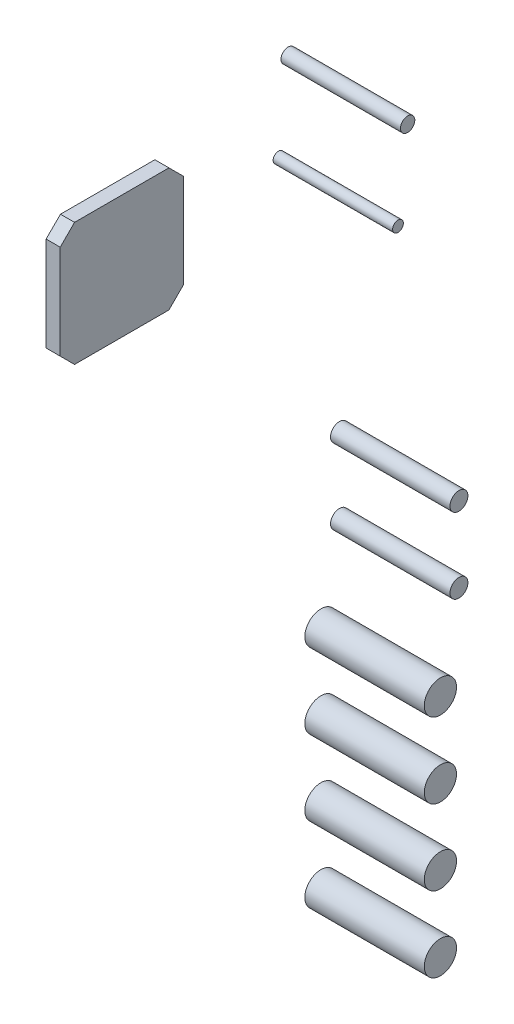
ISO-10303-21;
HEADER;
FILE_DESCRIPTION(('STEP AP214'),'2;1');
FILE_NAME('part.step','',(''),(''),'','','');
FILE_SCHEMA(('AUTOMOTIVE_DESIGN { 1 0 10303 214 1 1 1 1 }'));
ENDSEC;
DATA;
#1=APPLICATION_CONTEXT('core data for automotive mechanical design processes');
#2=APPLICATION_PROTOCOL_DEFINITION('international standard','automotive_design',2000,#1);
#3=PRODUCT_CONTEXT('',#1,'mechanical');
#4=PRODUCT('Part','Part','',(#3));
#5=PRODUCT_RELATED_PRODUCT_CATEGORY('part','',(#4));
#6=PRODUCT_DEFINITION_FORMATION('','',#4);
#7=PRODUCT_DEFINITION_CONTEXT('part definition',#1,'design');
#8=PRODUCT_DEFINITION('design','',#6,#7);
#9=PRODUCT_DEFINITION_SHAPE('','',#8);
#10=(LENGTH_UNIT() NAMED_UNIT(*) SI_UNIT(.MILLI.,.METRE.));
#11=(NAMED_UNIT(*) PLANE_ANGLE_UNIT() SI_UNIT($,.RADIAN.));
#12=(NAMED_UNIT(*) SI_UNIT($,.STERADIAN.) SOLID_ANGLE_UNIT());
#13=UNCERTAINTY_MEASURE_WITH_UNIT(LENGTH_MEASURE(1.E-05),#10,'distance_accuracy_value','');
#14=(GEOMETRIC_REPRESENTATION_CONTEXT(3) GLOBAL_UNCERTAINTY_ASSIGNED_CONTEXT((#13)) GLOBAL_UNIT_ASSIGNED_CONTEXT((#10,
#11,#12)) REPRESENTATION_CONTEXT('',''));
#15=CARTESIAN_POINT('',(0.,0.,0.));
#16=DIRECTION('',(0.,0.,1.));
#17=DIRECTION('',(1.,0.,0.));
#18=AXIS2_PLACEMENT_3D('',#15,#16,#17);
#19=CARTESIAN_POINT('',(11.8,412.5,114.));
#20=DIRECTION('',(0.,0.707106781186547,0.707106781186548));
#21=DIRECTION('',(0.,0.707106781186548,-0.707106781186547));
#22=AXIS2_PLACEMENT_3D('',#19,#20,#21);
#23=PLANE('',#22);
#24=DIRECTION('',(0.,0.707106781186548,-0.707106781186547));
#25=VECTOR('',#24,1.);
#26=CARTESIAN_POINT('',(0.,412.5,114.));
#27=LINE('',#26,#25);
#28=CARTESIAN_POINT('',(0.,412.5,114.));
#29=VERTEX_POINT('',#28);
#30=CARTESIAN_POINT('',(0.,424.5,102.));
#31=VERTEX_POINT('',#30);
#32=EDGE_CURVE('E122',#29,#31,#27,.T.);
#33=ORIENTED_EDGE('',*,*,#32,.T.);
#34=DIRECTION('',(-1.,0.,0.));
#35=VECTOR('',#34,1.);
#36=CARTESIAN_POINT('',(11.8,424.5,102.));
#37=LINE('',#36,#35);
#38=CARTESIAN_POINT('',(11.8,424.5,102.));
#39=VERTEX_POINT('',#38);
#40=EDGE_CURVE('E11',#39,#31,#37,.T.);
#41=ORIENTED_EDGE('',*,*,#40,.F.);
#42=DIRECTION('',(0.,0.707106781186548,-0.707106781186547));
#43=VECTOR('',#42,1.);
#44=CARTESIAN_POINT('',(11.8,412.5,114.));
#45=LINE('',#44,#43);
#46=CARTESIAN_POINT('',(11.8,412.5,114.));
#47=VERTEX_POINT('',#46);
#48=EDGE_CURVE('E116',#47,#39,#45,.T.);
#49=ORIENTED_EDGE('',*,*,#48,.F.);
#50=DIRECTION('',(-1.,0.,0.));
#51=VECTOR('',#50,1.);
#52=CARTESIAN_POINT('',(11.8,412.5,114.));
#53=LINE('',#52,#51);
#54=EDGE_CURVE('E112',#47,#29,#53,.T.);
#55=ORIENTED_EDGE('',*,*,#54,.T.);
#56=EDGE_LOOP('',(#33,#41,#49,#55));
#57=FACE_BOUND('',#56,.T.);
#58=ADVANCED_FACE('F17',(#57),#23,.F.);
#59=CARTESIAN_POINT('',(11.8,424.5,102.));
#60=DIRECTION('',(0.,0.,1.));
#61=DIRECTION('',(0.,1.,0.));
#62=AXIS2_PLACEMENT_3D('',#59,#60,#61);
#63=PLANE('',#62);
#64=DIRECTION('',(0.,1.,0.));
#65=VECTOR('',#64,1.);
#66=CARTESIAN_POINT('',(0.,424.5,102.));
#67=LINE('',#66,#65);
#68=CARTESIAN_POINT('',(0.,503.5,102.));
#69=VERTEX_POINT('',#68);
#70=EDGE_CURVE('E118',#31,#69,#67,.T.);
#71=ORIENTED_EDGE('',*,*,#70,.T.);
#72=DIRECTION('',(-1.,0.,0.));
#73=VECTOR('',#72,1.);
#74=CARTESIAN_POINT('',(11.8,503.5,102.));
#75=LINE('',#74,#73);
#76=CARTESIAN_POINT('',(11.8,503.5,102.));
#77=VERTEX_POINT('',#76);
#78=EDGE_CURVE('E27',#77,#69,#75,.T.);
#79=ORIENTED_EDGE('',*,*,#78,.F.);
#80=DIRECTION('',(0.,1.,0.));
#81=VECTOR('',#80,1.);
#82=CARTESIAN_POINT('',(11.8,424.5,102.));
#83=LINE('',#82,#81);
#84=EDGE_CURVE('E79',#39,#77,#83,.T.);
#85=ORIENTED_EDGE('',*,*,#84,.F.);
#86=ORIENTED_EDGE('',*,*,#40,.T.);
#87=EDGE_LOOP('',(#71,#79,#85,#86));
#88=FACE_BOUND('',#87,.T.);
#89=ADVANCED_FACE('F572',(#88),#63,.F.);
#90=CARTESIAN_POINT('',(11.8,515.5,114.));
#91=DIRECTION('',(0.,-0.707106781186548,0.707106781186547));
#92=DIRECTION('',(0.,0.707106781186547,0.707106781186548));
#93=AXIS2_PLACEMENT_3D('',#90,#91,#92);
#94=PLANE('',#93);
#95=DIRECTION('',(0.,0.707106781186547,0.707106781186548));
#96=VECTOR('',#95,1.);
#97=CARTESIAN_POINT('',(0.,515.5,114.));
#98=LINE('',#97,#96);
#99=CARTESIAN_POINT('',(0.,515.5,114.));
#100=VERTEX_POINT('',#99);
#101=EDGE_CURVE('E121',#69,#100,#98,.T.);
#102=ORIENTED_EDGE('',*,*,#101,.T.);
#103=DIRECTION('',(-1.,0.,0.));
#104=VECTOR('',#103,1.);
#105=CARTESIAN_POINT('',(11.8,515.5,114.));
#106=LINE('',#105,#104);
#107=CARTESIAN_POINT('',(11.8,515.5,114.));
#108=VERTEX_POINT('',#107);
#109=EDGE_CURVE('E147',#108,#100,#106,.T.);
#110=ORIENTED_EDGE('',*,*,#109,.F.);
#111=DIRECTION('',(0.,0.707106781186547,0.707106781186548));
#112=VECTOR('',#111,1.);
#113=CARTESIAN_POINT('',(11.8,515.5,114.));
#114=LINE('',#113,#112);
#115=EDGE_CURVE('E994',#77,#108,#114,.T.);
#116=ORIENTED_EDGE('',*,*,#115,.F.);
#117=ORIENTED_EDGE('',*,*,#78,.T.);
#118=EDGE_LOOP('',(#102,#110,#116,#117));
#119=FACE_BOUND('',#118,.T.);
#120=ADVANCED_FACE('F561',(#119),#94,.F.);
#121=CARTESIAN_POINT('',(11.8,515.5,114.));
#122=DIRECTION('',(0.,-1.,0.));
#123=DIRECTION('',(0.,0.,1.));
#124=AXIS2_PLACEMENT_3D('',#121,#122,#123);
#125=PLANE('',#124);
#126=DIRECTION('',(0.,0.,1.));
#127=VECTOR('',#126,1.);
#128=CARTESIAN_POINT('',(0.,515.5,114.));
#129=LINE('',#128,#127);
#130=CARTESIAN_POINT('',(0.,515.5,193.));
#131=VERTEX_POINT('',#130);
#132=EDGE_CURVE('E125',#100,#131,#129,.T.);
#133=ORIENTED_EDGE('',*,*,#132,.T.);
#134=DIRECTION('',(-1.,0.,0.));
#135=VECTOR('',#134,1.);
#136=CARTESIAN_POINT('',(11.8,515.5,193.));
#137=LINE('',#136,#135);
#138=CARTESIAN_POINT('',(11.8,515.5,193.));
#139=VERTEX_POINT('',#138);
#140=EDGE_CURVE('E144',#139,#131,#137,.T.);
#141=ORIENTED_EDGE('',*,*,#140,.F.);
#142=DIRECTION('',(0.,0.,1.));
#143=VECTOR('',#142,1.);
#144=CARTESIAN_POINT('',(11.8,515.5,114.));
#145=LINE('',#144,#143);
#146=EDGE_CURVE('E996',#108,#139,#145,.T.);
#147=ORIENTED_EDGE('',*,*,#146,.F.);
#148=ORIENTED_EDGE('',*,*,#109,.T.);
#149=EDGE_LOOP('',(#133,#141,#147,#148));
#150=FACE_BOUND('',#149,.T.);
#151=ADVANCED_FACE('F550',(#150),#125,.F.);
#152=CARTESIAN_POINT('',(11.8,503.5,205.));
#153=DIRECTION('',(0.,-0.707106781186548,-0.707106781186548));
#154=DIRECTION('',(0.,-0.707106781186548,0.707106781186548));
#155=AXIS2_PLACEMENT_3D('',#152,#153,#154);
#156=PLANE('',#155);
#157=DIRECTION('',(0.,-0.707106781186548,0.707106781186548));
#158=VECTOR('',#157,1.);
#159=CARTESIAN_POINT('',(0.,503.5,205.));
#160=LINE('',#159,#158);
#161=CARTESIAN_POINT('',(0.,503.5,205.));
#162=VERTEX_POINT('',#161);
#163=EDGE_CURVE('E128',#131,#162,#160,.T.);
#164=ORIENTED_EDGE('',*,*,#163,.T.);
#165=DIRECTION('',(-1.,0.,0.));
#166=VECTOR('',#165,1.);
#167=CARTESIAN_POINT('',(11.8,503.5,205.));
#168=LINE('',#167,#166);
#169=CARTESIAN_POINT('',(11.8,503.5,205.));
#170=VERTEX_POINT('',#169);
#171=EDGE_CURVE('E107',#170,#162,#168,.T.);
#172=ORIENTED_EDGE('',*,*,#171,.F.);
#173=DIRECTION('',(0.,-0.707106781186548,0.707106781186548));
#174=VECTOR('',#173,1.);
#175=CARTESIAN_POINT('',(11.8,503.5,205.));
#176=LINE('',#175,#174);
#177=EDGE_CURVE('E98',#139,#170,#176,.T.);
#178=ORIENTED_EDGE('',*,*,#177,.F.);
#179=ORIENTED_EDGE('',*,*,#140,.T.);
#180=EDGE_LOOP('',(#164,#172,#178,#179));
#181=FACE_BOUND('',#180,.T.);
#182=ADVANCED_FACE('F540',(#181),#156,.F.);
#183=CARTESIAN_POINT('',(11.8,503.5,205.));
#184=DIRECTION('',(0.,0.,-1.));
#185=DIRECTION('',(0.,-1.,0.));
#186=AXIS2_PLACEMENT_3D('',#183,#184,#185);
#187=PLANE('',#186);
#188=DIRECTION('',(0.,-1.,0.));
#189=VECTOR('',#188,1.);
#190=CARTESIAN_POINT('',(0.,503.5,205.));
#191=LINE('',#190,#189);
#192=CARTESIAN_POINT('',(0.,424.5,205.));
#193=VERTEX_POINT('',#192);
#194=EDGE_CURVE('E106',#162,#193,#191,.T.);
#195=ORIENTED_EDGE('',*,*,#194,.T.);
#196=DIRECTION('',(-1.,0.,0.));
#197=VECTOR('',#196,1.);
#198=CARTESIAN_POINT('',(11.8,424.5,205.));
#199=LINE('',#198,#197);
#200=CARTESIAN_POINT('',(11.8,424.5,205.));
#201=VERTEX_POINT('',#200);
#202=EDGE_CURVE('E103',#201,#193,#199,.T.);
#203=ORIENTED_EDGE('',*,*,#202,.F.);
#204=DIRECTION('',(0.,-1.,0.));
#205=VECTOR('',#204,1.);
#206=CARTESIAN_POINT('',(11.8,503.5,205.));
#207=LINE('',#206,#205);
#208=EDGE_CURVE('E92',#170,#201,#207,.T.);
#209=ORIENTED_EDGE('',*,*,#208,.F.);
#210=ORIENTED_EDGE('',*,*,#171,.T.);
#211=EDGE_LOOP('',(#195,#203,#209,#210));
#212=FACE_BOUND('',#211,.T.);
#213=ADVANCED_FACE('F104',(#212),#187,.F.);
#214=CARTESIAN_POINT('',(11.8,412.5,193.));
#215=DIRECTION('',(0.,0.707106781186548,-0.707106781186547));
#216=DIRECTION('',(0.,-0.707106781186547,-0.707106781186548));
#217=AXIS2_PLACEMENT_3D('',#214,#215,#216);
#218=PLANE('',#217);
#219=DIRECTION('',(0.,-0.707106781186547,-0.707106781186548));
#220=VECTOR('',#219,1.);
#221=CARTESIAN_POINT('',(0.,412.5,193.));
#222=LINE('',#221,#220);
#223=CARTESIAN_POINT('',(0.,412.5,193.));
#224=VERTEX_POINT('',#223);
#225=EDGE_CURVE('E65',#193,#224,#222,.T.);
#226=ORIENTED_EDGE('',*,*,#225,.T.);
#227=DIRECTION('',(-1.,0.,0.));
#228=VECTOR('',#227,1.);
#229=CARTESIAN_POINT('',(11.8,412.5,193.));
#230=LINE('',#229,#228);
#231=CARTESIAN_POINT('',(11.8,412.5,193.));
#232=VERTEX_POINT('',#231);
#233=EDGE_CURVE('E108',#232,#224,#230,.T.);
#234=ORIENTED_EDGE('',*,*,#233,.F.);
#235=DIRECTION('',(0.,-0.707106781186547,-0.707106781186548));
#236=VECTOR('',#235,1.);
#237=CARTESIAN_POINT('',(11.8,412.5,193.));
#238=LINE('',#237,#236);
#239=EDGE_CURVE('E96',#201,#232,#238,.T.);
#240=ORIENTED_EDGE('',*,*,#239,.F.);
#241=ORIENTED_EDGE('',*,*,#202,.T.);
#242=EDGE_LOOP('',(#226,#234,#240,#241));
#243=FACE_BOUND('',#242,.T.);
#244=ADVANCED_FACE('F110',(#243),#218,.F.);
#245=CARTESIAN_POINT('',(11.8,412.5,193.));
#246=DIRECTION('',(0.,1.,0.));
#247=DIRECTION('',(0.,0.,-1.));
#248=AXIS2_PLACEMENT_3D('',#245,#246,#247);
#249=PLANE('',#248);
#250=DIRECTION('',(0.,0.,-1.));
#251=VECTOR('',#250,1.);
#252=CARTESIAN_POINT('',(0.,412.5,193.));
#253=LINE('',#252,#251);
#254=EDGE_CURVE('E71',#224,#29,#253,.T.);
#255=ORIENTED_EDGE('',*,*,#254,.T.);
#256=ORIENTED_EDGE('',*,*,#54,.F.);
#257=DIRECTION('',(0.,0.,-1.));
#258=VECTOR('',#257,1.);
#259=CARTESIAN_POINT('',(11.8,412.5,193.));
#260=LINE('',#259,#258);
#261=EDGE_CURVE('E36',#232,#47,#260,.T.);
#262=ORIENTED_EDGE('',*,*,#261,.F.);
#263=ORIENTED_EDGE('',*,*,#233,.T.);
#264=EDGE_LOOP('',(#255,#256,#262,#263));
#265=FACE_BOUND('',#264,.T.);
#266=ADVANCED_FACE('F512',(#265),#249,.F.);
#267=CARTESIAN_POINT('',(11.8,464.,153.5));
#268=DIRECTION('',(1.,0.,0.));
#269=DIRECTION('',(0.,0.,-1.));
#270=AXIS2_PLACEMENT_3D('',#267,#268,#269);
#271=PLANE('',#270);
#272=ORIENTED_EDGE('',*,*,#48,.T.);
#273=ORIENTED_EDGE('',*,*,#84,.T.);
#274=ORIENTED_EDGE('',*,*,#115,.T.);
#275=ORIENTED_EDGE('',*,*,#146,.T.);
#276=ORIENTED_EDGE('',*,*,#177,.T.);
#277=ORIENTED_EDGE('',*,*,#208,.T.);
#278=ORIENTED_EDGE('',*,*,#239,.T.);
#279=ORIENTED_EDGE('',*,*,#261,.T.);
#280=EDGE_LOOP('',(#272,#273,#274,#275,#276,#277,#278,#279));
#281=FACE_BOUND('',#280,.T.);
#282=ADVANCED_FACE('F94',(#281),#271,.T.);
#283=CARTESIAN_POINT('',(0.,464.,153.5));
#284=DIRECTION('',(1.,0.,0.));
#285=DIRECTION('',(0.,0.,-1.));
#286=AXIS2_PLACEMENT_3D('',#283,#284,#285);
#287=PLANE('',#286);
#288=ORIENTED_EDGE('',*,*,#32,.F.);
#289=ORIENTED_EDGE('',*,*,#254,.F.);
#290=ORIENTED_EDGE('',*,*,#225,.F.);
#291=ORIENTED_EDGE('',*,*,#194,.F.);
#292=ORIENTED_EDGE('',*,*,#163,.F.);
#293=ORIENTED_EDGE('',*,*,#132,.F.);
#294=ORIENTED_EDGE('',*,*,#101,.F.);
#295=ORIENTED_EDGE('',*,*,#70,.F.);
#296=EDGE_LOOP('',(#288,#289,#290,#291,#292,#293,#294,#295));
#297=FACE_BOUND('',#296,.T.);
#298=ADVANCED_FACE('F498',(#297),#287,.F.);
#299=CLOSED_SHELL('',(#58,#89,#120,#151,#182,#213,#244,#266,#282,#298));
#300=MANIFOLD_SOLID_BREP('B1',#299);
#301=CARTESIAN_POINT('',(242.,60.,117.));
#302=DIRECTION('',(-1.,0.,0.));
#303=DIRECTION('',(0.,0.,1.));
#304=AXIS2_PLACEMENT_3D('',#301,#302,#303);
#305=CYLINDRICAL_SURFACE('',#304,13.5);
#306=CARTESIAN_POINT('',(242.,60.,117.));
#307=DIRECTION('',(-1.,0.,0.));
#308=DIRECTION('',(0.,1.,0.));
#309=AXIS2_PLACEMENT_3D('',#306,#307,#308);
#310=CIRCLE('',#309,13.5);
#311=CARTESIAN_POINT('',(242.,73.5,117.));
#312=VERTEX_POINT('',#311);
#313=EDGE_CURVE('E140',#312,#312,#310,.T.);
#314=ORIENTED_EDGE('',*,*,#313,.T.);
#315=EDGE_LOOP('',(#314));
#316=FACE_BOUND('',#315,.T.);
#317=CARTESIAN_POINT('',(142.,60.,117.));
#318=DIRECTION('',(-1.,0.,0.));
#319=DIRECTION('',(0.,1.,0.));
#320=AXIS2_PLACEMENT_3D('',#317,#318,#319);
#321=CIRCLE('',#320,13.5);
#322=CARTESIAN_POINT('',(142.,73.5,117.));
#323=VERTEX_POINT('',#322);
#324=EDGE_CURVE('E154',#323,#323,#321,.T.);
#325=ORIENTED_EDGE('',*,*,#324,.F.);
#326=EDGE_LOOP('',(#325));
#327=FACE_BOUND('',#326,.T.);
#328=ADVANCED_FACE('F480',(#316,#327),#305,.T.);
#329=CARTESIAN_POINT('',(242.,60.,117.));
#330=DIRECTION('',(-1.,0.,0.));
#331=DIRECTION('',(0.,-1.,0.));
#332=AXIS2_PLACEMENT_3D('',#329,#330,#331);
#333=PLANE('',#332);
#334=ORIENTED_EDGE('',*,*,#313,.F.);
#335=EDGE_LOOP('',(#334));
#336=FACE_BOUND('',#335,.T.);
#337=ADVANCED_FACE('F467',(#336),#333,.F.);
#338=CARTESIAN_POINT('',(142.,60.,117.));
#339=DIRECTION('',(-1.,0.,0.));
#340=DIRECTION('',(0.,-1.,0.));
#341=AXIS2_PLACEMENT_3D('',#338,#339,#340);
#342=PLANE('',#341);
#343=ORIENTED_EDGE('',*,*,#324,.T.);
#344=EDGE_LOOP('',(#343));
#345=FACE_BOUND('',#344,.T.);
#346=ADVANCED_FACE('F463',(#345),#342,.T.);
#347=CLOSED_SHELL('',(#328,#337,#346));
#348=MANIFOLD_SOLID_BREP('B1',#347);
#349=CARTESIAN_POINT('',(142.,123.,117.));
#350=DIRECTION('',(1.,0.,0.));
#351=DIRECTION('',(0.,0.924224592736303,0.381849318686592));
#352=AXIS2_PLACEMENT_3D('',#349,#350,#351);
#353=CYLINDRICAL_SURFACE('',#352,13.5);
#354=CARTESIAN_POINT('',(142.,123.,117.));
#355=DIRECTION('',(1.,0.,0.));
#356=DIRECTION('',(0.,-0.381849318686592,0.924224592736303));
#357=AXIS2_PLACEMENT_3D('',#354,#355,#356);
#358=CIRCLE('',#357,13.5);
#359=CARTESIAN_POINT('',(142.,117.845034197731,129.47703200194));
#360=VERTEX_POINT('',#359);
#361=EDGE_CURVE('E158',#360,#360,#358,.T.);
#362=ORIENTED_EDGE('',*,*,#361,.T.);
#363=EDGE_LOOP('',(#362));
#364=FACE_BOUND('',#363,.T.);
#365=CARTESIAN_POINT('',(242.,123.,117.));
#366=DIRECTION('',(1.,0.,0.));
#367=DIRECTION('',(0.,-0.381849318686592,0.924224592736303));
#368=AXIS2_PLACEMENT_3D('',#365,#366,#367);
#369=CIRCLE('',#368,13.5);
#370=CARTESIAN_POINT('',(242.,117.845034197731,129.47703200194));
#371=VERTEX_POINT('',#370);
#372=EDGE_CURVE('E161',#371,#371,#369,.T.);
#373=ORIENTED_EDGE('',*,*,#372,.F.);
#374=EDGE_LOOP('',(#373));
#375=FACE_BOUND('',#374,.T.);
#376=ADVANCED_FACE('F445',(#364,#375),#353,.T.);
#377=CARTESIAN_POINT('',(142.,123.,117.));
#378=DIRECTION('',(1.,0.,0.));
#379=DIRECTION('',(0.,0.381849318686592,-0.924224592736303));
#380=AXIS2_PLACEMENT_3D('',#377,#378,#379);
#381=PLANE('',#380);
#382=ORIENTED_EDGE('',*,*,#361,.F.);
#383=EDGE_LOOP('',(#382));
#384=FACE_BOUND('',#383,.T.);
#385=ADVANCED_FACE('F432',(#384),#381,.F.);
#386=CARTESIAN_POINT('',(242.,123.,117.));
#387=DIRECTION('',(1.,0.,0.));
#388=DIRECTION('',(0.,0.381849318686592,-0.924224592736303));
#389=AXIS2_PLACEMENT_3D('',#386,#387,#388);
#390=PLANE('',#389);
#391=ORIENTED_EDGE('',*,*,#372,.T.);
#392=EDGE_LOOP('',(#391));
#393=FACE_BOUND('',#392,.T.);
#394=ADVANCED_FACE('F428',(#393),#390,.T.);
#395=CLOSED_SHELL('',(#376,#385,#394));
#396=MANIFOLD_SOLID_BREP('B1',#395);
#397=CARTESIAN_POINT('',(142.,186.,117.));
#398=DIRECTION('',(1.,0.,0.));
#399=DIRECTION('',(0.,0.924224592736303,0.381849318686592));
#400=AXIS2_PLACEMENT_3D('',#397,#398,#399);
#401=CYLINDRICAL_SURFACE('',#400,13.5);
#402=CARTESIAN_POINT('',(142.,186.,117.));
#403=DIRECTION('',(1.,0.,0.));
#404=DIRECTION('',(0.,-0.381849318686592,0.924224592736303));
#405=AXIS2_PLACEMENT_3D('',#402,#403,#404);
#406=CIRCLE('',#405,13.5);
#407=CARTESIAN_POINT('',(142.,180.845034197731,129.47703200194));
#408=VERTEX_POINT('',#407);
#409=EDGE_CURVE('E165',#408,#408,#406,.T.);
#410=ORIENTED_EDGE('',*,*,#409,.T.);
#411=EDGE_LOOP('',(#410));
#412=FACE_BOUND('',#411,.T.);
#413=CARTESIAN_POINT('',(242.,186.,117.));
#414=DIRECTION('',(1.,0.,0.));
#415=DIRECTION('',(0.,-0.381849318686592,0.924224592736303));
#416=AXIS2_PLACEMENT_3D('',#413,#414,#415);
#417=CIRCLE('',#416,13.5);
#418=CARTESIAN_POINT('',(242.,180.845034197731,129.47703200194));
#419=VERTEX_POINT('',#418);
#420=EDGE_CURVE('E168',#419,#419,#417,.T.);
#421=ORIENTED_EDGE('',*,*,#420,.F.);
#422=EDGE_LOOP('',(#421));
#423=FACE_BOUND('',#422,.T.);
#424=ADVANCED_FACE('F410',(#412,#423),#401,.T.);
#425=CARTESIAN_POINT('',(142.,186.,117.));
#426=DIRECTION('',(1.,0.,0.));
#427=DIRECTION('',(0.,0.381849318686592,-0.924224592736303));
#428=AXIS2_PLACEMENT_3D('',#425,#426,#427);
#429=PLANE('',#428);
#430=ORIENTED_EDGE('',*,*,#409,.F.);
#431=EDGE_LOOP('',(#430));
#432=FACE_BOUND('',#431,.T.);
#433=ADVANCED_FACE('F397',(#432),#429,.F.);
#434=CARTESIAN_POINT('',(242.,186.,117.));
#435=DIRECTION('',(1.,0.,0.));
#436=DIRECTION('',(0.,0.381849318686592,-0.924224592736303));
#437=AXIS2_PLACEMENT_3D('',#434,#435,#436);
#438=PLANE('',#437);
#439=ORIENTED_EDGE('',*,*,#420,.T.);
#440=EDGE_LOOP('',(#439));
#441=FACE_BOUND('',#440,.T.);
#442=ADVANCED_FACE('F393',(#441),#438,.T.);
#443=CLOSED_SHELL('',(#424,#433,#442));
#444=MANIFOLD_SOLID_BREP('B1',#443);
#445=CARTESIAN_POINT('',(142.,249.,117.));
#446=DIRECTION('',(1.,0.,0.));
#447=DIRECTION('',(0.,0.924224592736303,0.381849318686592));
#448=AXIS2_PLACEMENT_3D('',#445,#446,#447);
#449=CYLINDRICAL_SURFACE('',#448,13.5);
#450=CARTESIAN_POINT('',(142.,249.,117.));
#451=DIRECTION('',(1.,0.,0.));
#452=DIRECTION('',(0.,-0.381849318686592,0.924224592736303));
#453=AXIS2_PLACEMENT_3D('',#450,#451,#452);
#454=CIRCLE('',#453,13.5);
#455=CARTESIAN_POINT('',(142.,243.845034197731,129.47703200194));
#456=VERTEX_POINT('',#455);
#457=EDGE_CURVE('E172',#456,#456,#454,.T.);
#458=ORIENTED_EDGE('',*,*,#457,.T.);
#459=EDGE_LOOP('',(#458));
#460=FACE_BOUND('',#459,.T.);
#461=CARTESIAN_POINT('',(242.,249.,117.));
#462=DIRECTION('',(1.,0.,0.));
#463=DIRECTION('',(0.,-0.381849318686592,0.924224592736303));
#464=AXIS2_PLACEMENT_3D('',#461,#462,#463);
#465=CIRCLE('',#464,13.5);
#466=CARTESIAN_POINT('',(242.,243.845034197731,129.47703200194));
#467=VERTEX_POINT('',#466);
#468=EDGE_CURVE('E175',#467,#467,#465,.T.);
#469=ORIENTED_EDGE('',*,*,#468,.F.);
#470=EDGE_LOOP('',(#469));
#471=FACE_BOUND('',#470,.T.);
#472=ADVANCED_FACE('F375',(#460,#471),#449,.T.);
#473=CARTESIAN_POINT('',(142.,249.,117.));
#474=DIRECTION('',(1.,0.,0.));
#475=DIRECTION('',(0.,0.381849318686592,-0.924224592736303));
#476=AXIS2_PLACEMENT_3D('',#473,#474,#475);
#477=PLANE('',#476);
#478=ORIENTED_EDGE('',*,*,#457,.F.);
#479=EDGE_LOOP('',(#478));
#480=FACE_BOUND('',#479,.T.);
#481=ADVANCED_FACE('F362',(#480),#477,.F.);
#482=CARTESIAN_POINT('',(242.,249.,117.));
#483=DIRECTION('',(1.,0.,0.));
#484=DIRECTION('',(0.,0.381849318686592,-0.924224592736303));
#485=AXIS2_PLACEMENT_3D('',#482,#483,#484);
#486=PLANE('',#485);
#487=ORIENTED_EDGE('',*,*,#468,.T.);
#488=EDGE_LOOP('',(#487));
#489=FACE_BOUND('',#488,.T.);
#490=ADVANCED_FACE('F358',(#489),#486,.T.);
#491=CLOSED_SHELL('',(#472,#481,#490));
#492=MANIFOLD_SOLID_BREP('B1',#491);
#493=CARTESIAN_POINT('',(134.,312.,93.5));
#494=DIRECTION('',(1.,0.,0.));
#495=DIRECTION('',(0.,0.924224592736303,0.381849318686592));
#496=AXIS2_PLACEMENT_3D('',#493,#494,#495);
#497=CYLINDRICAL_SURFACE('',#496,7.5);
#498=CARTESIAN_POINT('',(134.,312.,93.5));
#499=DIRECTION('',(1.,0.,0.));
#500=DIRECTION('',(0.,-0.381849318686592,0.924224592736303));
#501=AXIS2_PLACEMENT_3D('',#498,#499,#500);
#502=CIRCLE('',#501,7.5);
#503=CARTESIAN_POINT('',(134.,309.136130109851,100.431684445522));
#504=VERTEX_POINT('',#503);
#505=EDGE_CURVE('E179',#504,#504,#502,.T.);
#506=ORIENTED_EDGE('',*,*,#505,.T.);
#507=EDGE_LOOP('',(#506));
#508=FACE_BOUND('',#507,.T.);
#509=CARTESIAN_POINT('',(234.,312.,93.5));
#510=DIRECTION('',(1.,0.,0.));
#511=DIRECTION('',(0.,-0.381849318686592,0.924224592736303));
#512=AXIS2_PLACEMENT_3D('',#509,#510,#511);
#513=CIRCLE('',#512,7.5);
#514=CARTESIAN_POINT('',(234.,309.136130109851,100.431684445522));
#515=VERTEX_POINT('',#514);
#516=EDGE_CURVE('E182',#515,#515,#513,.T.);
#517=ORIENTED_EDGE('',*,*,#516,.F.);
#518=EDGE_LOOP('',(#517));
#519=FACE_BOUND('',#518,.T.);
#520=ADVANCED_FACE('F340',(#508,#519),#497,.T.);
#521=CARTESIAN_POINT('',(134.,312.,93.5));
#522=DIRECTION('',(1.,0.,0.));
#523=DIRECTION('',(0.,0.381849318686592,-0.924224592736303));
#524=AXIS2_PLACEMENT_3D('',#521,#522,#523);
#525=PLANE('',#524);
#526=ORIENTED_EDGE('',*,*,#505,.F.);
#527=EDGE_LOOP('',(#526));
#528=FACE_BOUND('',#527,.T.);
#529=ADVANCED_FACE('F327',(#528),#525,.F.);
#530=CARTESIAN_POINT('',(234.,312.,93.5));
#531=DIRECTION('',(1.,0.,0.));
#532=DIRECTION('',(0.,0.381849318686592,-0.924224592736303));
#533=AXIS2_PLACEMENT_3D('',#530,#531,#532);
#534=PLANE('',#533);
#535=ORIENTED_EDGE('',*,*,#516,.T.);
#536=EDGE_LOOP('',(#535));
#537=FACE_BOUND('',#536,.T.);
#538=ADVANCED_FACE('F323',(#537),#534,.T.);
#539=CLOSED_SHELL('',(#520,#529,#538));
#540=MANIFOLD_SOLID_BREP('B1',#539);
#541=CARTESIAN_POINT('',(134.,375.,93.5));
#542=DIRECTION('',(1.,0.,0.));
#543=DIRECTION('',(0.,0.924224592736303,0.381849318686592));
#544=AXIS2_PLACEMENT_3D('',#541,#542,#543);
#545=CYLINDRICAL_SURFACE('',#544,7.5);
#546=CARTESIAN_POINT('',(134.,375.,93.5));
#547=DIRECTION('',(1.,0.,0.));
#548=DIRECTION('',(0.,-0.381849318686592,0.924224592736303));
#549=AXIS2_PLACEMENT_3D('',#546,#547,#548);
#550=CIRCLE('',#549,7.5);
#551=CARTESIAN_POINT('',(134.,372.136130109851,100.431684445522));
#552=VERTEX_POINT('',#551);
#553=EDGE_CURVE('E186',#552,#552,#550,.T.);
#554=ORIENTED_EDGE('',*,*,#553,.T.);
#555=EDGE_LOOP('',(#554));
#556=FACE_BOUND('',#555,.T.);
#557=CARTESIAN_POINT('',(234.,375.,93.5));
#558=DIRECTION('',(1.,0.,0.));
#559=DIRECTION('',(0.,-0.381849318686592,0.924224592736303));
#560=AXIS2_PLACEMENT_3D('',#557,#558,#559);
#561=CIRCLE('',#560,7.5);
#562=CARTESIAN_POINT('',(234.,372.136130109851,100.431684445522));
#563=VERTEX_POINT('',#562);
#564=EDGE_CURVE('E189',#563,#563,#561,.T.);
#565=ORIENTED_EDGE('',*,*,#564,.F.);
#566=EDGE_LOOP('',(#565));
#567=FACE_BOUND('',#566,.T.);
#568=ADVANCED_FACE('F305',(#556,#567),#545,.T.);
#569=CARTESIAN_POINT('',(134.,375.,93.5));
#570=DIRECTION('',(1.,0.,0.));
#571=DIRECTION('',(0.,0.381849318686592,-0.924224592736303));
#572=AXIS2_PLACEMENT_3D('',#569,#570,#571);
#573=PLANE('',#572);
#574=ORIENTED_EDGE('',*,*,#553,.F.);
#575=EDGE_LOOP('',(#574));
#576=FACE_BOUND('',#575,.T.);
#577=ADVANCED_FACE('F293',(#576),#573,.F.);
#578=CARTESIAN_POINT('',(234.,375.,93.5));
#579=DIRECTION('',(1.,0.,0.));
#580=DIRECTION('',(0.,0.381849318686592,-0.924224592736303));
#581=AXIS2_PLACEMENT_3D('',#578,#579,#580);
#582=PLANE('',#581);
#583=ORIENTED_EDGE('',*,*,#564,.T.);
#584=EDGE_LOOP('',(#583));
#585=FACE_BOUND('',#584,.T.);
#586=ADVANCED_FACE('F289',(#585),#582,.T.);
#587=CLOSED_SHELL('',(#568,#577,#586));
#588=MANIFOLD_SOLID_BREP('B1',#587);
#589=CARTESIAN_POINT('',(123.07,658.5,125.5));
#590=DIRECTION('',(1.,0.,0.));
#591=DIRECTION('',(0.,0.924224592736303,0.381849318686592));
#592=AXIS2_PLACEMENT_3D('',#589,#590,#591);
#593=CYLINDRICAL_SURFACE('',#592,6.);
#594=CARTESIAN_POINT('',(123.07,658.5,125.5));
#595=DIRECTION('',(1.,0.,0.));
#596=DIRECTION('',(0.,-0.381849318686592,0.924224592736303));
#597=AXIS2_PLACEMENT_3D('',#594,#595,#596);
#598=CIRCLE('',#597,6.);
#599=CARTESIAN_POINT('',(123.07,656.20890408788,131.045347556418));
#600=VERTEX_POINT('',#599);
#601=EDGE_CURVE('E193',#600,#600,#598,.T.);
#602=ORIENTED_EDGE('',*,*,#601,.T.);
#603=EDGE_LOOP('',(#602));
#604=FACE_BOUND('',#603,.T.);
#605=CARTESIAN_POINT('',(223.07,658.5,125.5));
#606=DIRECTION('',(1.,0.,0.));
#607=DIRECTION('',(0.,-0.381849318686592,0.924224592736303));
#608=AXIS2_PLACEMENT_3D('',#605,#606,#607);
#609=CIRCLE('',#608,6.);
#610=CARTESIAN_POINT('',(223.07,656.20890408788,131.045347556418));
#611=VERTEX_POINT('',#610);
#612=EDGE_CURVE('E196',#611,#611,#609,.T.);
#613=ORIENTED_EDGE('',*,*,#612,.F.);
#614=EDGE_LOOP('',(#613));
#615=FACE_BOUND('',#614,.T.);
#616=ADVANCED_FACE('F228',(#604,#615),#593,.T.);
#617=CARTESIAN_POINT('',(123.07,658.5,125.5));
#618=DIRECTION('',(1.,0.,0.));
#619=DIRECTION('',(0.,0.381849318686592,-0.924224592736303));
#620=AXIS2_PLACEMENT_3D('',#617,#618,#619);
#621=PLANE('',#620);
#622=ORIENTED_EDGE('',*,*,#601,.F.);
#623=EDGE_LOOP('',(#622));
#624=FACE_BOUND('',#623,.T.);
#625=ADVANCED_FACE('F230',(#624),#621,.F.);
#626=CARTESIAN_POINT('',(223.07,658.5,125.5));
#627=DIRECTION('',(1.,0.,0.));
#628=DIRECTION('',(0.,0.381849318686592,-0.924224592736303));
#629=AXIS2_PLACEMENT_3D('',#626,#627,#628);
#630=PLANE('',#629);
#631=ORIENTED_EDGE('',*,*,#612,.T.);
#632=EDGE_LOOP('',(#631));
#633=FACE_BOUND('',#632,.T.);
#634=ADVANCED_FACE('F238',(#633),#630,.T.);
#635=CLOSED_SHELL('',(#616,#625,#634));
#636=MANIFOLD_SOLID_BREP('B1',#635);
#637=CARTESIAN_POINT('',(108.,573.5,118.5));
#638=DIRECTION('',(1.,0.,0.));
#639=DIRECTION('',(0.,0.924224592736303,0.381849318686592));
#640=AXIS2_PLACEMENT_3D('',#637,#638,#639);
#641=CYLINDRICAL_SURFACE('',#640,4.5);
#642=CARTESIAN_POINT('',(108.,573.5,118.5));
#643=DIRECTION('',(1.,0.,0.));
#644=DIRECTION('',(0.,-0.381849318686592,0.924224592736303));
#645=AXIS2_PLACEMENT_3D('',#642,#643,#644);
#646=CIRCLE('',#645,4.5);
#647=CARTESIAN_POINT('',(108.,571.78167806591,122.659010667313));
#648=VERTEX_POINT('',#647);
#649=EDGE_CURVE('E199',#648,#648,#646,.T.);
#650=ORIENTED_EDGE('',*,*,#649,.T.);
#651=EDGE_LOOP('',(#650));
#652=FACE_BOUND('',#651,.T.);
#653=CARTESIAN_POINT('',(208.,573.5,118.5));
#654=DIRECTION('',(1.,0.,0.));
#655=DIRECTION('',(0.,-0.381849318686592,0.924224592736303));
#656=AXIS2_PLACEMENT_3D('',#653,#654,#655);
#657=CIRCLE('',#656,4.5);
#658=CARTESIAN_POINT('',(208.,571.78167806591,122.659010667313));
#659=VERTEX_POINT('',#658);
#660=EDGE_CURVE('E21',#659,#659,#657,.T.);
#661=ORIENTED_EDGE('',*,*,#660,.F.);
#662=EDGE_LOOP('',(#661));
#663=FACE_BOUND('',#662,.T.);
#664=ADVANCED_FACE('F19',(#652,#663),#641,.T.);
#665=CARTESIAN_POINT('',(108.,573.5,118.5));
#666=DIRECTION('',(1.,0.,0.));
#667=DIRECTION('',(0.,0.381849318686592,-0.924224592736303));
#668=AXIS2_PLACEMENT_3D('',#665,#666,#667);
#669=PLANE('',#668);
#670=ORIENTED_EDGE('',*,*,#649,.F.);
#671=EDGE_LOOP('',(#670));
#672=FACE_BOUND('',#671,.T.);
#673=ADVANCED_FACE('F212',(#672),#669,.F.);
#674=CARTESIAN_POINT('',(208.,573.5,118.5));
#675=DIRECTION('',(1.,0.,0.));
#676=DIRECTION('',(0.,0.381849318686592,-0.924224592736303));
#677=AXIS2_PLACEMENT_3D('',#674,#675,#676);
#678=PLANE('',#677);
#679=ORIENTED_EDGE('',*,*,#660,.T.);
#680=EDGE_LOOP('',(#679));
#681=FACE_BOUND('',#680,.T.);
#682=ADVANCED_FACE('F209',(#681),#678,.T.);
#683=CLOSED_SHELL('',(#664,#673,#682));
#684=MANIFOLD_SOLID_BREP('B1',#683);
#685=ADVANCED_BREP_SHAPE_REPRESENTATION('',(#18,#300,#348,#396,#444,#492,#540,#588,#636,#684),#14);
#686=SHAPE_DEFINITION_REPRESENTATION(#9,#685);
ENDSEC;
END-ISO-10303-21;
